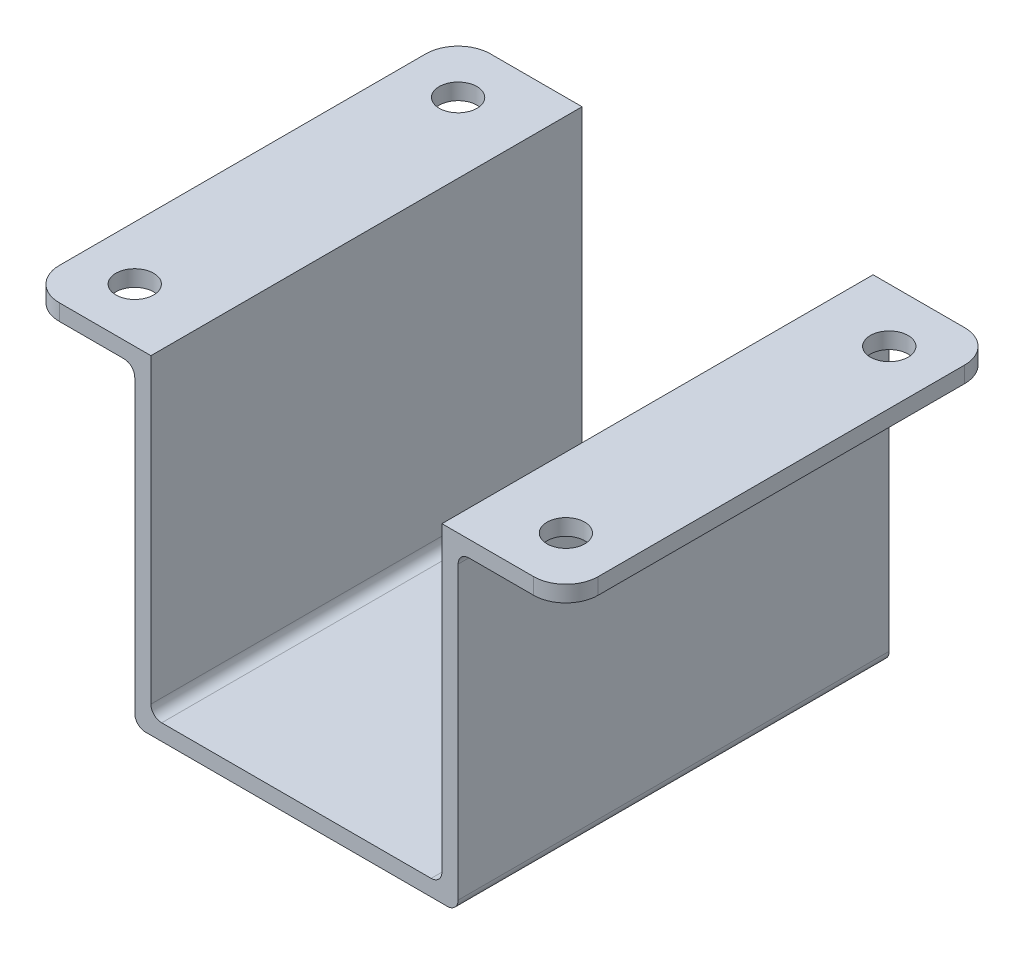
ISO-10303-21;
HEADER;
FILE_DESCRIPTION(('STEP AP214'),'2;1');
FILE_NAME('part.step','',(''),(''),'','','');
FILE_SCHEMA(('AUTOMOTIVE_DESIGN { 1 0 10303 214 1 1 1 1 }'));
ENDSEC;
DATA;
#1=APPLICATION_CONTEXT('core data for automotive mechanical design processes');
#2=APPLICATION_PROTOCOL_DEFINITION('international standard','automotive_design',2000,#1);
#3=PRODUCT_CONTEXT('',#1,'mechanical');
#4=PRODUCT('Part','Part','',(#3));
#5=PRODUCT_RELATED_PRODUCT_CATEGORY('part','',(#4));
#6=PRODUCT_DEFINITION_FORMATION('','',#4);
#7=PRODUCT_DEFINITION_CONTEXT('part definition',#1,'design');
#8=PRODUCT_DEFINITION('design','',#6,#7);
#9=PRODUCT_DEFINITION_SHAPE('','',#8);
#10=(LENGTH_UNIT() NAMED_UNIT(*) SI_UNIT(.MILLI.,.METRE.));
#11=(NAMED_UNIT(*) PLANE_ANGLE_UNIT() SI_UNIT($,.RADIAN.));
#12=(NAMED_UNIT(*) SI_UNIT($,.STERADIAN.) SOLID_ANGLE_UNIT());
#13=UNCERTAINTY_MEASURE_WITH_UNIT(LENGTH_MEASURE(1.E-05),#10,'distance_accuracy_value','');
#14=(GEOMETRIC_REPRESENTATION_CONTEXT(3) GLOBAL_UNCERTAINTY_ASSIGNED_CONTEXT((#13)) GLOBAL_UNIT_ASSIGNED_CONTEXT((#10,
#11,#12)) REPRESENTATION_CONTEXT('',''));
#15=CARTESIAN_POINT('',(0.,0.,0.));
#16=DIRECTION('',(0.,0.,1.));
#17=DIRECTION('',(1.,0.,0.));
#18=AXIS2_PLACEMENT_3D('',#15,#16,#17);
#19=CARTESIAN_POINT('',(0.,1.5,0.));
#20=DIRECTION('',(0.,1.,0.));
#21=DIRECTION('',(0.,0.,1.));
#22=AXIS2_PLACEMENT_3D('',#19,#20,#21);
#23=PLANE('',#22);
#24=DIRECTION('',(1.,0.,0.));
#25=VECTOR('',#24,1.);
#26=CARTESIAN_POINT('',(-15.,1.5,20.));
#27=LINE('',#26,#25);
#28=CARTESIAN_POINT('',(-12.5,1.5,20.));
#29=VERTEX_POINT('',#28);
#30=CARTESIAN_POINT('',(12.5,1.5,20.));
#31=VERTEX_POINT('',#30);
#32=EDGE_CURVE('E292',#29,#31,#27,.T.);
#33=ORIENTED_EDGE('',*,*,#32,.T.);
#34=DIRECTION('',(0.,0.,1.));
#35=VECTOR('',#34,1.);
#36=CARTESIAN_POINT('',(12.5,1.5,-20.));
#37=LINE('',#36,#35);
#38=CARTESIAN_POINT('',(12.5,1.5,-20.));
#39=VERTEX_POINT('',#38);
#40=EDGE_CURVE('E352',#31,#39,#37,.F.);
#41=ORIENTED_EDGE('',*,*,#40,.T.);
#42=DIRECTION('',(-1.,0.,0.));
#43=VECTOR('',#42,1.);
#44=CARTESIAN_POINT('',(-15.,1.5,-20.));
#45=LINE('',#44,#43);
#46=CARTESIAN_POINT('',(-12.5,1.5,-20.));
#47=VERTEX_POINT('',#46);
#48=EDGE_CURVE('E296',#39,#47,#45,.T.);
#49=ORIENTED_EDGE('',*,*,#48,.T.);
#50=DIRECTION('',(0.,0.,-1.));
#51=VECTOR('',#50,1.);
#52=CARTESIAN_POINT('',(-12.5,1.5,20.));
#53=LINE('',#52,#51);
#54=EDGE_CURVE('E349',#47,#29,#53,.F.);
#55=ORIENTED_EDGE('',*,*,#54,.T.);
#56=EDGE_LOOP('',(#33,#41,#49,#55));
#57=FACE_BOUND('',#56,.T.);
#58=CARTESIAN_POINT('',(0.,1.5,0.));
#59=DIRECTION('',(0.,1.,0.));
#60=DIRECTION('',(0.,0.,1.));
#61=AXIS2_PLACEMENT_3D('',#58,#59,#60);
#62=CIRCLE('',#61,4.25);
#63=CARTESIAN_POINT('',(0.,1.5,4.25));
#64=VERTEX_POINT('',#63);
#65=EDGE_CURVE('E284',#64,#64,#62,.T.);
#66=ORIENTED_EDGE('',*,*,#65,.F.);
#67=EDGE_LOOP('',(#66));
#68=FACE_BOUND('',#67,.T.);
#69=ADVANCED_FACE('F39',(#57,#68),#23,.T.);
#70=CARTESIAN_POINT('',(0.,0.,0.));
#71=DIRECTION('',(0.,1.,0.));
#72=DIRECTION('',(0.,0.,1.));
#73=AXIS2_PLACEMENT_3D('',#70,#71,#72);
#74=PLANE('',#73);
#75=DIRECTION('',(-1.,0.,0.));
#76=VECTOR('',#75,1.);
#77=CARTESIAN_POINT('',(-15.,0.,-20.));
#78=LINE('',#77,#76);
#79=CARTESIAN_POINT('',(14.,0.,-20.));
#80=VERTEX_POINT('',#79);
#81=CARTESIAN_POINT('',(-14.,0.,-20.));
#82=VERTEX_POINT('',#81);
#83=EDGE_CURVE('E297',#80,#82,#78,.T.);
#84=ORIENTED_EDGE('',*,*,#83,.F.);
#85=DIRECTION('',(0.,0.,-1.));
#86=VECTOR('',#85,1.);
#87=CARTESIAN_POINT('',(14.,0.,0.));
#88=LINE('',#87,#86);
#89=CARTESIAN_POINT('',(14.,0.,20.));
#90=VERTEX_POINT('',#89);
#91=EDGE_CURVE('E368',#80,#90,#88,.F.);
#92=ORIENTED_EDGE('',*,*,#91,.T.);
#93=DIRECTION('',(1.,0.,0.));
#94=VECTOR('',#93,1.);
#95=CARTESIAN_POINT('',(-15.,0.,20.));
#96=LINE('',#95,#94);
#97=CARTESIAN_POINT('',(-14.,0.,20.));
#98=VERTEX_POINT('',#97);
#99=EDGE_CURVE('E288',#98,#90,#96,.T.);
#100=ORIENTED_EDGE('',*,*,#99,.F.);
#101=DIRECTION('',(0.,0.,1.));
#102=VECTOR('',#101,1.);
#103=CARTESIAN_POINT('',(-14.,0.,0.));
#104=LINE('',#103,#102);
#105=EDGE_CURVE('E365',#98,#82,#104,.F.);
#106=ORIENTED_EDGE('',*,*,#105,.T.);
#107=EDGE_LOOP('',(#84,#92,#100,#106));
#108=FACE_BOUND('',#107,.T.);
#109=CARTESIAN_POINT('',(0.,0.,0.));
#110=DIRECTION('',(0.,1.,0.));
#111=DIRECTION('',(0.,0.,1.));
#112=AXIS2_PLACEMENT_3D('',#109,#110,#111);
#113=CIRCLE('',#112,4.25);
#114=CARTESIAN_POINT('',(0.,0.,4.25));
#115=VERTEX_POINT('',#114);
#116=EDGE_CURVE('E280',#115,#115,#113,.T.);
#117=ORIENTED_EDGE('',*,*,#116,.T.);
#118=EDGE_LOOP('',(#117));
#119=FACE_BOUND('',#118,.T.);
#120=ADVANCED_FACE('F485',(#108,#119),#74,.F.);
#121=CARTESIAN_POINT('',(-15.,1.5,-20.));
#122=DIRECTION('',(1.,0.,0.));
#123=DIRECTION('',(0.,0.,-1.));
#124=AXIS2_PLACEMENT_3D('',#121,#122,#123);
#125=PLANE('',#124);
#126=DIRECTION('',(0.,-1.,0.));
#127=VECTOR('',#126,1.);
#128=CARTESIAN_POINT('',(-15.,1.5,20.));
#129=LINE('',#128,#127);
#130=CARTESIAN_POINT('',(-15.,28.,20.));
#131=VERTEX_POINT('',#130);
#132=CARTESIAN_POINT('',(-15.,1.,20.));
#133=VERTEX_POINT('',#132);
#134=EDGE_CURVE('E319',#131,#133,#129,.T.);
#135=ORIENTED_EDGE('',*,*,#134,.F.);
#136=DIRECTION('',(0.,0.,-1.));
#137=VECTOR('',#136,1.);
#138=CARTESIAN_POINT('',(-15.,28.,-20.));
#139=LINE('',#138,#137);
#140=CARTESIAN_POINT('',(-15.,28.,-20.));
#141=VERTEX_POINT('',#140);
#142=EDGE_CURVE('E338',#131,#141,#139,.T.);
#143=ORIENTED_EDGE('',*,*,#142,.T.);
#144=DIRECTION('',(0.,-1.,0.));
#145=VECTOR('',#144,1.);
#146=CARTESIAN_POINT('',(-15.,1.5,-20.));
#147=LINE('',#146,#145);
#148=CARTESIAN_POINT('',(-15.,1.,-20.));
#149=VERTEX_POINT('',#148);
#150=EDGE_CURVE('E301',#141,#149,#147,.T.);
#151=ORIENTED_EDGE('',*,*,#150,.T.);
#152=DIRECTION('',(0.,0.,1.));
#153=VECTOR('',#152,1.);
#154=CARTESIAN_POINT('',(-15.,1.,-20.));
#155=LINE('',#154,#153);
#156=EDGE_CURVE('E334',#149,#133,#155,.T.);
#157=ORIENTED_EDGE('',*,*,#156,.T.);
#158=EDGE_LOOP('',(#135,#143,#151,#157));
#159=FACE_BOUND('',#158,.T.);
#160=ADVANCED_FACE('F475',(#159),#125,.F.);
#161=CARTESIAN_POINT('',(-15.,1.5,20.));
#162=DIRECTION('',(0.,0.,-1.));
#163=DIRECTION('',(-1.,0.,0.));
#164=AXIS2_PLACEMENT_3D('',#161,#162,#163);
#165=PLANE('',#164);
#166=DIRECTION('',(-1.,0.,0.));
#167=VECTOR('',#166,1.);
#168=CARTESIAN_POINT('',(13.5,29.,20.));
#169=LINE('',#168,#167);
#170=CARTESIAN_POINT('',(22.,29.,20.));
#171=VERTEX_POINT('',#170);
#172=CARTESIAN_POINT('',(16.,29.,20.));
#173=VERTEX_POINT('',#172);
#174=EDGE_CURVE('E500',#171,#173,#169,.T.);
#175=ORIENTED_EDGE('',*,*,#174,.F.);
#176=DIRECTION('',(0.,1.,0.));
#177=VECTOR('',#176,1.);
#178=CARTESIAN_POINT('',(22.,1.5,20.));
#179=LINE('',#178,#177);
#180=CARTESIAN_POINT('',(22.,30.5,20.));
#181=VERTEX_POINT('',#180);
#182=EDGE_CURVE('E11',#171,#181,#179,.T.);
#183=ORIENTED_EDGE('',*,*,#182,.T.);
#184=DIRECTION('',(1.,0.,0.));
#185=VECTOR('',#184,1.);
#186=CARTESIAN_POINT('',(13.5,30.5,20.));
#187=LINE('',#186,#185);
#188=CARTESIAN_POINT('',(13.5,30.5,20.));
#189=VERTEX_POINT('',#188);
#190=EDGE_CURVE('E213',#189,#181,#187,.T.);
#191=ORIENTED_EDGE('',*,*,#190,.F.);
#192=DIRECTION('',(0.,1.,0.));
#193=VECTOR('',#192,1.);
#194=CARTESIAN_POINT('',(13.5,0.,20.));
#195=LINE('',#194,#193);
#196=CARTESIAN_POINT('',(13.5,2.5,20.));
#197=VERTEX_POINT('',#196);
#198=EDGE_CURVE('E198',#197,#189,#195,.T.);
#199=ORIENTED_EDGE('',*,*,#198,.F.);
#200=CARTESIAN_POINT('',(12.5,2.5,20.));
#201=DIRECTION('',(0.,0.,-1.));
#202=DIRECTION('',(-1.,0.,0.));
#203=AXIS2_PLACEMENT_3D('',#200,#201,#202);
#204=CIRCLE('',#203,1.);
#205=EDGE_CURVE('E390',#197,#31,#204,.T.);
#206=ORIENTED_EDGE('',*,*,#205,.T.);
#207=ORIENTED_EDGE('',*,*,#32,.F.);
#208=CARTESIAN_POINT('',(-12.5,2.5,20.));
#209=DIRECTION('',(0.,0.,-1.));
#210=DIRECTION('',(-1.,0.,0.));
#211=AXIS2_PLACEMENT_3D('',#208,#209,#210);
#212=CIRCLE('',#211,1.);
#213=CARTESIAN_POINT('',(-13.5,2.5,20.));
#214=VERTEX_POINT('',#213);
#215=EDGE_CURVE('E398',#29,#214,#212,.T.);
#216=ORIENTED_EDGE('',*,*,#215,.T.);
#217=DIRECTION('',(0.,1.,0.));
#218=VECTOR('',#217,1.);
#219=CARTESIAN_POINT('',(-13.5,0.,20.));
#220=LINE('',#219,#218);
#221=CARTESIAN_POINT('',(-13.5,30.5,20.));
#222=VERTEX_POINT('',#221);
#223=EDGE_CURVE('E268',#214,#222,#220,.T.);
#224=ORIENTED_EDGE('',*,*,#223,.T.);
#225=DIRECTION('',(-1.,0.,0.));
#226=VECTOR('',#225,1.);
#227=CARTESIAN_POINT('',(-13.5,30.5,20.));
#228=LINE('',#227,#226);
#229=CARTESIAN_POINT('',(-22.,30.5,20.));
#230=VERTEX_POINT('',#229);
#231=EDGE_CURVE('E275',#222,#230,#228,.T.);
#232=ORIENTED_EDGE('',*,*,#231,.T.);
#233=DIRECTION('',(0.,1.,0.));
#234=VECTOR('',#233,1.);
#235=CARTESIAN_POINT('',(-22.,29.,20.));
#236=LINE('',#235,#234);
#237=CARTESIAN_POINT('',(-22.,29.,20.));
#238=VERTEX_POINT('',#237);
#239=EDGE_CURVE('E48',#230,#238,#236,.F.);
#240=ORIENTED_EDGE('',*,*,#239,.T.);
#241=DIRECTION('',(1.,0.,0.));
#242=VECTOR('',#241,1.);
#243=CARTESIAN_POINT('',(-13.5,29.,20.));
#244=LINE('',#243,#242);
#245=CARTESIAN_POINT('',(-16.,29.,20.));
#246=VERTEX_POINT('',#245);
#247=EDGE_CURVE('E258',#238,#246,#244,.T.);
#248=ORIENTED_EDGE('',*,*,#247,.T.);
#249=CARTESIAN_POINT('',(-16.,28.,20.));
#250=DIRECTION('',(0.,0.,-1.));
#251=DIRECTION('',(-1.,0.,0.));
#252=AXIS2_PLACEMENT_3D('',#249,#250,#251);
#253=CIRCLE('',#252,1.);
#254=EDGE_CURVE('E387',#246,#131,#253,.T.);
#255=ORIENTED_EDGE('',*,*,#254,.T.);
#256=ORIENTED_EDGE('',*,*,#134,.T.);
#257=CARTESIAN_POINT('',(-14.,1.,20.));
#258=DIRECTION('',(0.,0.,-1.));
#259=DIRECTION('',(-1.,0.,0.));
#260=AXIS2_PLACEMENT_3D('',#257,#258,#259);
#261=CIRCLE('',#260,1.);
#262=EDGE_CURVE('E371',#133,#98,#261,.F.);
#263=ORIENTED_EDGE('',*,*,#262,.T.);
#264=ORIENTED_EDGE('',*,*,#99,.T.);
#265=CARTESIAN_POINT('',(14.,1.,20.));
#266=DIRECTION('',(0.,0.,-1.));
#267=DIRECTION('',(-1.,0.,0.));
#268=AXIS2_PLACEMENT_3D('',#265,#266,#267);
#269=CIRCLE('',#268,1.);
#270=CARTESIAN_POINT('',(15.,1.,20.));
#271=VERTEX_POINT('',#270);
#272=EDGE_CURVE('E374',#90,#271,#269,.F.);
#273=ORIENTED_EDGE('',*,*,#272,.T.);
#274=DIRECTION('',(0.,-1.,0.));
#275=VECTOR('',#274,1.);
#276=CARTESIAN_POINT('',(15.,1.5,20.));
#277=LINE('',#276,#275);
#278=CARTESIAN_POINT('',(15.,28.,20.));
#279=VERTEX_POINT('',#278);
#280=EDGE_CURVE('E315',#279,#271,#277,.T.);
#281=ORIENTED_EDGE('',*,*,#280,.F.);
#282=CARTESIAN_POINT('',(16.,28.,20.));
#283=DIRECTION('',(0.,0.,-1.));
#284=DIRECTION('',(-1.,0.,0.));
#285=AXIS2_PLACEMENT_3D('',#282,#283,#284);
#286=CIRCLE('',#285,1.);
#287=EDGE_CURVE('E377',#279,#173,#286,.T.);
#288=ORIENTED_EDGE('',*,*,#287,.T.);
#289=EDGE_LOOP('',(#175,#183,#191,#199,#206,#207,#216,#224,#232,#240,#248,#255,#256,#263,#264,
#273,#281,#288));
#290=FACE_BOUND('',#289,.T.);
#291=ADVANCED_FACE('F446',(#290),#165,.F.);
#292=CARTESIAN_POINT('',(15.,1.5,-20.));
#293=DIRECTION('',(-1.,0.,0.));
#294=DIRECTION('',(0.,0.,1.));
#295=AXIS2_PLACEMENT_3D('',#292,#293,#294);
#296=PLANE('',#295);
#297=DIRECTION('',(0.,-1.,0.));
#298=VECTOR('',#297,1.);
#299=CARTESIAN_POINT('',(15.,1.5,-20.));
#300=LINE('',#299,#298);
#301=CARTESIAN_POINT('',(15.,28.,-20.));
#302=VERTEX_POINT('',#301);
#303=CARTESIAN_POINT('',(15.,1.,-20.));
#304=VERTEX_POINT('',#303);
#305=EDGE_CURVE('E311',#302,#304,#300,.T.);
#306=ORIENTED_EDGE('',*,*,#305,.F.);
#307=DIRECTION('',(0.,0.,1.));
#308=VECTOR('',#307,1.);
#309=CARTESIAN_POINT('',(15.,28.,-20.));
#310=LINE('',#309,#308);
#311=EDGE_CURVE('E327',#302,#279,#310,.T.);
#312=ORIENTED_EDGE('',*,*,#311,.T.);
#313=ORIENTED_EDGE('',*,*,#280,.T.);
#314=DIRECTION('',(0.,0.,-1.));
#315=VECTOR('',#314,1.);
#316=CARTESIAN_POINT('',(15.,1.,-20.));
#317=LINE('',#316,#315);
#318=EDGE_CURVE('E323',#271,#304,#317,.T.);
#319=ORIENTED_EDGE('',*,*,#318,.T.);
#320=EDGE_LOOP('',(#306,#312,#313,#319));
#321=FACE_BOUND('',#320,.T.);
#322=ADVANCED_FACE('F494',(#321),#296,.F.);
#323=CARTESIAN_POINT('',(-15.,1.5,-20.));
#324=DIRECTION('',(0.,0.,1.));
#325=DIRECTION('',(1.,0.,0.));
#326=AXIS2_PLACEMENT_3D('',#323,#324,#325);
#327=PLANE('',#326);
#328=DIRECTION('',(-1.,0.,0.));
#329=VECTOR('',#328,1.);
#330=CARTESIAN_POINT('',(-13.5,29.,-20.));
#331=LINE('',#330,#329);
#332=CARTESIAN_POINT('',(-16.,29.,-20.));
#333=VERTEX_POINT('',#332);
#334=CARTESIAN_POINT('',(-22.,29.,-20.));
#335=VERTEX_POINT('',#334);
#336=EDGE_CURVE('E251',#333,#335,#331,.T.);
#337=ORIENTED_EDGE('',*,*,#336,.T.);
#338=DIRECTION('',(0.,1.,0.));
#339=VECTOR('',#338,1.);
#340=CARTESIAN_POINT('',(-22.,30.5,-20.));
#341=LINE('',#340,#339);
#342=CARTESIAN_POINT('',(-22.,30.5,-20.));
#343=VERTEX_POINT('',#342);
#344=EDGE_CURVE('E404',#335,#343,#341,.T.);
#345=ORIENTED_EDGE('',*,*,#344,.T.);
#346=DIRECTION('',(-1.,0.,0.));
#347=VECTOR('',#346,1.);
#348=CARTESIAN_POINT('',(-13.5,30.5,-20.));
#349=LINE('',#348,#347);
#350=CARTESIAN_POINT('',(-13.5,30.5,-20.));
#351=VERTEX_POINT('',#350);
#352=EDGE_CURVE('E276',#351,#343,#349,.T.);
#353=ORIENTED_EDGE('',*,*,#352,.F.);
#354=DIRECTION('',(0.,-1.,0.));
#355=VECTOR('',#354,1.);
#356=CARTESIAN_POINT('',(-13.5,0.,-20.));
#357=LINE('',#356,#355);
#358=CARTESIAN_POINT('',(-13.5,2.5,-20.));
#359=VERTEX_POINT('',#358);
#360=EDGE_CURVE('E261',#351,#359,#357,.T.);
#361=ORIENTED_EDGE('',*,*,#360,.T.);
#362=CARTESIAN_POINT('',(-12.5,2.5,-20.));
#363=DIRECTION('',(0.,0.,1.));
#364=DIRECTION('',(1.,0.,0.));
#365=AXIS2_PLACEMENT_3D('',#362,#363,#364);
#366=CIRCLE('',#365,1.);
#367=EDGE_CURVE('E395',#359,#47,#366,.T.);
#368=ORIENTED_EDGE('',*,*,#367,.T.);
#369=ORIENTED_EDGE('',*,*,#48,.F.);
#370=CARTESIAN_POINT('',(12.5,2.5,-20.));
#371=DIRECTION('',(0.,0.,1.));
#372=DIRECTION('',(1.,0.,0.));
#373=AXIS2_PLACEMENT_3D('',#370,#371,#372);
#374=CIRCLE('',#373,1.);
#375=CARTESIAN_POINT('',(13.5,2.5,-20.));
#376=VERTEX_POINT('',#375);
#377=EDGE_CURVE('E219',#39,#376,#374,.T.);
#378=ORIENTED_EDGE('',*,*,#377,.T.);
#379=DIRECTION('',(0.,-1.,0.));
#380=VECTOR('',#379,1.);
#381=CARTESIAN_POINT('',(13.5,0.,-20.));
#382=LINE('',#381,#380);
#383=CARTESIAN_POINT('',(13.5,30.5,-20.));
#384=VERTEX_POINT('',#383);
#385=EDGE_CURVE('E195',#384,#376,#382,.T.);
#386=ORIENTED_EDGE('',*,*,#385,.F.);
#387=DIRECTION('',(1.,0.,0.));
#388=VECTOR('',#387,1.);
#389=CARTESIAN_POINT('',(13.5,30.5,-20.));
#390=LINE('',#389,#388);
#391=CARTESIAN_POINT('',(22.,30.5,-20.));
#392=VERTEX_POINT('',#391);
#393=EDGE_CURVE('E205',#384,#392,#390,.T.);
#394=ORIENTED_EDGE('',*,*,#393,.T.);
#395=DIRECTION('',(0.,1.,0.));
#396=VECTOR('',#395,1.);
#397=CARTESIAN_POINT('',(22.,1.5,-20.));
#398=LINE('',#397,#396);
#399=CARTESIAN_POINT('',(22.,29.,-20.));
#400=VERTEX_POINT('',#399);
#401=EDGE_CURVE('E401',#392,#400,#398,.F.);
#402=ORIENTED_EDGE('',*,*,#401,.T.);
#403=DIRECTION('',(1.,0.,0.));
#404=VECTOR('',#403,1.);
#405=CARTESIAN_POINT('',(13.5,29.,-20.));
#406=LINE('',#405,#404);
#407=CARTESIAN_POINT('',(16.,29.,-20.));
#408=VERTEX_POINT('',#407);
#409=EDGE_CURVE('E221',#408,#400,#406,.T.);
#410=ORIENTED_EDGE('',*,*,#409,.F.);
#411=CARTESIAN_POINT('',(16.,28.,-20.));
#412=DIRECTION('',(0.,0.,1.));
#413=DIRECTION('',(1.,0.,0.));
#414=AXIS2_PLACEMENT_3D('',#411,#412,#413);
#415=CIRCLE('',#414,1.);
#416=EDGE_CURVE('E381',#408,#302,#415,.T.);
#417=ORIENTED_EDGE('',*,*,#416,.T.);
#418=ORIENTED_EDGE('',*,*,#305,.T.);
#419=CARTESIAN_POINT('',(14.,1.,-20.));
#420=DIRECTION('',(0.,0.,1.));
#421=DIRECTION('',(1.,0.,0.));
#422=AXIS2_PLACEMENT_3D('',#419,#420,#421);
#423=CIRCLE('',#422,1.);
#424=EDGE_CURVE('E362',#304,#80,#423,.F.);
#425=ORIENTED_EDGE('',*,*,#424,.T.);
#426=ORIENTED_EDGE('',*,*,#83,.T.);
#427=CARTESIAN_POINT('',(-14.,1.,-20.));
#428=DIRECTION('',(0.,0.,1.));
#429=DIRECTION('',(1.,0.,0.));
#430=AXIS2_PLACEMENT_3D('',#427,#428,#429);
#431=CIRCLE('',#430,1.);
#432=EDGE_CURVE('E359',#82,#149,#431,.F.);
#433=ORIENTED_EDGE('',*,*,#432,.T.);
#434=ORIENTED_EDGE('',*,*,#150,.F.);
#435=CARTESIAN_POINT('',(-16.,28.,-20.));
#436=DIRECTION('',(0.,0.,1.));
#437=DIRECTION('',(1.,0.,0.));
#438=AXIS2_PLACEMENT_3D('',#435,#436,#437);
#439=CIRCLE('',#438,1.);
#440=EDGE_CURVE('E384',#141,#333,#439,.T.);
#441=ORIENTED_EDGE('',*,*,#440,.T.);
#442=EDGE_LOOP('',(#337,#345,#353,#361,#368,#369,#378,#386,#394,#402,#410,#417,#418,#425,#426,
#433,#434,#441));
#443=FACE_BOUND('',#442,.T.);
#444=ADVANCED_FACE('F216',(#443),#327,.F.);
#445=CARTESIAN_POINT('',(0.,1.5,0.));
#446=DIRECTION('',(0.,-1.,0.));
#447=DIRECTION('',(0.,0.,-1.));
#448=AXIS2_PLACEMENT_3D('',#445,#446,#447);
#449=CYLINDRICAL_SURFACE('',#448,4.25);
#450=ORIENTED_EDGE('',*,*,#65,.T.);
#451=EDGE_LOOP('',(#450));
#452=FACE_BOUND('',#451,.T.);
#453=ORIENTED_EDGE('',*,*,#116,.F.);
#454=EDGE_LOOP('',(#453));
#455=FACE_BOUND('',#454,.T.);
#456=ADVANCED_FACE('F564',(#452,#455),#449,.F.);
#457=CARTESIAN_POINT('',(-13.5,30.5,-20.));
#458=DIRECTION('',(0.,1.,0.));
#459=DIRECTION('',(0.,0.,1.));
#460=AXIS2_PLACEMENT_3D('',#457,#458,#459);
#461=PLANE('',#460);
#462=ORIENTED_EDGE('',*,*,#352,.T.);
#463=CARTESIAN_POINT('',(-22.,30.5,-17.));
#464=DIRECTION('',(0.,1.,0.));
#465=DIRECTION('',(0.,0.,1.));
#466=AXIS2_PLACEMENT_3D('',#463,#464,#465);
#467=CIRCLE('',#466,3.);
#468=CARTESIAN_POINT('',(-25.,30.5,-17.));
#469=VERTEX_POINT('',#468);
#470=EDGE_CURVE('E411',#343,#469,#467,.T.);
#471=ORIENTED_EDGE('',*,*,#470,.T.);
#472=DIRECTION('',(0.,0.,1.));
#473=VECTOR('',#472,1.);
#474=CARTESIAN_POINT('',(-25.,30.5,-20.));
#475=LINE('',#474,#473);
#476=CARTESIAN_POINT('',(-25.,30.5,17.));
#477=VERTEX_POINT('',#476);
#478=EDGE_CURVE('E247',#469,#477,#475,.T.);
#479=ORIENTED_EDGE('',*,*,#478,.T.);
#480=CARTESIAN_POINT('',(-22.,30.5,17.));
#481=DIRECTION('',(0.,1.,0.));
#482=DIRECTION('',(0.,0.,1.));
#483=AXIS2_PLACEMENT_3D('',#480,#481,#482);
#484=CIRCLE('',#483,3.);
#485=EDGE_CURVE('E408',#477,#230,#484,.T.);
#486=ORIENTED_EDGE('',*,*,#485,.T.);
#487=ORIENTED_EDGE('',*,*,#231,.F.);
#488=DIRECTION('',(0.,0.,-1.));
#489=VECTOR('',#488,1.);
#490=CARTESIAN_POINT('',(-13.5,30.5,-20.));
#491=LINE('',#490,#489);
#492=EDGE_CURVE('E271',#222,#351,#491,.T.);
#493=ORIENTED_EDGE('',*,*,#492,.T.);
#494=EDGE_LOOP('',(#462,#471,#479,#486,#487,#493));
#495=FACE_BOUND('',#494,.T.);
#496=CARTESIAN_POINT('',(-19.9999999999997,30.5,15.));
#497=DIRECTION('',(0.,1.,0.));
#498=DIRECTION('',(0.,0.,1.));
#499=AXIS2_PLACEMENT_3D('',#496,#497,#498);
#500=CIRCLE('',#499,1.75);
#501=CARTESIAN_POINT('',(-19.9999999999997,30.5,16.75));
#502=VERTEX_POINT('',#501);
#503=EDGE_CURVE('E233',#502,#502,#500,.T.);
#504=ORIENTED_EDGE('',*,*,#503,.F.);
#505=EDGE_LOOP('',(#504));
#506=FACE_BOUND('',#505,.T.);
#507=CARTESIAN_POINT('',(-20.,30.5,-15.));
#508=DIRECTION('',(0.,1.,0.));
#509=DIRECTION('',(0.,0.,1.));
#510=AXIS2_PLACEMENT_3D('',#507,#508,#509);
#511=CIRCLE('',#510,1.75);
#512=CARTESIAN_POINT('',(-20.,30.5,-13.25));
#513=VERTEX_POINT('',#512);
#514=EDGE_CURVE('E239',#513,#513,#511,.T.);
#515=ORIENTED_EDGE('',*,*,#514,.F.);
#516=EDGE_LOOP('',(#515));
#517=FACE_BOUND('',#516,.T.);
#518=ADVANCED_FACE('F462',(#495,#506,#517),#461,.T.);
#519=CARTESIAN_POINT('',(-13.5,0.,0.));
#520=DIRECTION('',(1.,0.,0.));
#521=DIRECTION('',(0.,0.,-1.));
#522=AXIS2_PLACEMENT_3D('',#519,#520,#521);
#523=PLANE('',#522);
#524=ORIENTED_EDGE('',*,*,#223,.F.);
#525=DIRECTION('',(0.,0.,-1.));
#526=VECTOR('',#525,1.);
#527=CARTESIAN_POINT('',(-13.5,2.5,-20.));
#528=LINE('',#527,#526);
#529=EDGE_CURVE('E355',#214,#359,#528,.T.);
#530=ORIENTED_EDGE('',*,*,#529,.T.);
#531=ORIENTED_EDGE('',*,*,#360,.F.);
#532=ORIENTED_EDGE('',*,*,#492,.F.);
#533=EDGE_LOOP('',(#524,#530,#531,#532));
#534=FACE_BOUND('',#533,.T.);
#535=ADVANCED_FACE('F662',(#534),#523,.T.);
#536=CARTESIAN_POINT('',(0.,29.,0.));
#537=DIRECTION('',(0.,-1.,0.));
#538=DIRECTION('',(0.,0.,-1.));
#539=AXIS2_PLACEMENT_3D('',#536,#537,#538);
#540=PLANE('',#539);
#541=CARTESIAN_POINT('',(-20.,29.,-15.));
#542=DIRECTION('',(0.,1.,0.));
#543=DIRECTION('',(0.,0.,1.));
#544=AXIS2_PLACEMENT_3D('',#541,#542,#543);
#545=CIRCLE('',#544,1.75);
#546=CARTESIAN_POINT('',(-20.,29.,-13.25));
#547=VERTEX_POINT('',#546);
#548=EDGE_CURVE('E243',#547,#547,#545,.T.);
#549=ORIENTED_EDGE('',*,*,#548,.T.);
#550=EDGE_LOOP('',(#549));
#551=FACE_BOUND('',#550,.T.);
#552=CARTESIAN_POINT('',(-19.9999999999997,29.,15.));
#553=DIRECTION('',(0.,1.,0.));
#554=DIRECTION('',(0.,0.,1.));
#555=AXIS2_PLACEMENT_3D('',#552,#553,#554);
#556=CIRCLE('',#555,1.75);
#557=CARTESIAN_POINT('',(-19.9999999999997,29.,16.75));
#558=VERTEX_POINT('',#557);
#559=EDGE_CURVE('E235',#558,#558,#556,.T.);
#560=ORIENTED_EDGE('',*,*,#559,.T.);
#561=EDGE_LOOP('',(#560));
#562=FACE_BOUND('',#561,.T.);
#563=DIRECTION('',(0.,0.,1.));
#564=VECTOR('',#563,1.);
#565=CARTESIAN_POINT('',(-25.,29.,-20.));
#566=LINE('',#565,#564);
#567=CARTESIAN_POINT('',(-25.,29.,-17.));
#568=VERTEX_POINT('',#567);
#569=CARTESIAN_POINT('',(-25.,29.,17.));
#570=VERTEX_POINT('',#569);
#571=EDGE_CURVE('E254',#568,#570,#566,.T.);
#572=ORIENTED_EDGE('',*,*,#571,.F.);
#573=CARTESIAN_POINT('',(-22.,29.,-17.));
#574=DIRECTION('',(0.,-1.,0.));
#575=DIRECTION('',(0.,0.,-1.));
#576=AXIS2_PLACEMENT_3D('',#573,#574,#575);
#577=CIRCLE('',#576,3.);
#578=EDGE_CURVE('E424',#568,#335,#577,.T.);
#579=ORIENTED_EDGE('',*,*,#578,.T.);
#580=ORIENTED_EDGE('',*,*,#336,.F.);
#581=DIRECTION('',(0.,0.,-1.));
#582=VECTOR('',#581,1.);
#583=CARTESIAN_POINT('',(-16.,29.,0.));
#584=LINE('',#583,#582);
#585=EDGE_CURVE('E342',#333,#246,#584,.F.);
#586=ORIENTED_EDGE('',*,*,#585,.T.);
#587=ORIENTED_EDGE('',*,*,#247,.F.);
#588=CARTESIAN_POINT('',(-22.,29.,17.));
#589=DIRECTION('',(0.,-1.,0.));
#590=DIRECTION('',(0.,0.,-1.));
#591=AXIS2_PLACEMENT_3D('',#588,#589,#590);
#592=CIRCLE('',#591,3.);
#593=EDGE_CURVE('E421',#238,#570,#592,.T.);
#594=ORIENTED_EDGE('',*,*,#593,.T.);
#595=EDGE_LOOP('',(#572,#579,#580,#586,#587,#594));
#596=FACE_BOUND('',#595,.T.);
#597=ADVANCED_FACE('F452',(#551,#562,#596),#540,.T.);
#598=CARTESIAN_POINT('',(-25.,29.,-20.));
#599=DIRECTION('',(-1.,0.,0.));
#600=DIRECTION('',(0.,0.,1.));
#601=AXIS2_PLACEMENT_3D('',#598,#599,#600);
#602=PLANE('',#601);
#603=ORIENTED_EDGE('',*,*,#478,.F.);
#604=DIRECTION('',(0.,1.,0.));
#605=VECTOR('',#604,1.);
#606=CARTESIAN_POINT('',(-25.,29.,-17.));
#607=LINE('',#606,#605);
#608=EDGE_CURVE('E418',#469,#568,#607,.F.);
#609=ORIENTED_EDGE('',*,*,#608,.T.);
#610=ORIENTED_EDGE('',*,*,#571,.T.);
#611=DIRECTION('',(0.,1.,0.));
#612=VECTOR('',#611,1.);
#613=CARTESIAN_POINT('',(-25.,30.5,17.));
#614=LINE('',#613,#612);
#615=EDGE_CURVE('E414',#570,#477,#614,.T.);
#616=ORIENTED_EDGE('',*,*,#615,.T.);
#617=EDGE_LOOP('',(#603,#609,#610,#616));
#618=FACE_BOUND('',#617,.T.);
#619=ADVANCED_FACE('F459',(#618),#602,.T.);
#620=CARTESIAN_POINT('',(-20.,29.,-15.));
#621=DIRECTION('',(0.,1.,0.));
#622=DIRECTION('',(0.,0.,1.));
#623=AXIS2_PLACEMENT_3D('',#620,#621,#622);
#624=CYLINDRICAL_SURFACE('',#623,1.75);
#625=ORIENTED_EDGE('',*,*,#548,.F.);
#626=EDGE_LOOP('',(#625));
#627=FACE_BOUND('',#626,.T.);
#628=ORIENTED_EDGE('',*,*,#514,.T.);
#629=EDGE_LOOP('',(#628));
#630=FACE_BOUND('',#629,.T.);
#631=ADVANCED_FACE('F651',(#627,#630),#624,.F.);
#632=CARTESIAN_POINT('',(-19.9999999999997,29.,15.));
#633=DIRECTION('',(0.,1.,0.));
#634=DIRECTION('',(0.,0.,1.));
#635=AXIS2_PLACEMENT_3D('',#632,#633,#634);
#636=CYLINDRICAL_SURFACE('',#635,1.75);
#637=ORIENTED_EDGE('',*,*,#559,.F.);
#638=EDGE_LOOP('',(#637));
#639=FACE_BOUND('',#638,.T.);
#640=ORIENTED_EDGE('',*,*,#503,.T.);
#641=EDGE_LOOP('',(#640));
#642=FACE_BOUND('',#641,.T.);
#643=ADVANCED_FACE('F546',(#639,#642),#636,.F.);
#644=CARTESIAN_POINT('',(13.5,30.5,-20.));
#645=DIRECTION('',(0.,-1.,0.));
#646=DIRECTION('',(0.,0.,-1.));
#647=AXIS2_PLACEMENT_3D('',#644,#645,#646);
#648=PLANE('',#647);
#649=DIRECTION('',(0.,0.,1.));
#650=VECTOR('',#649,1.);
#651=CARTESIAN_POINT('',(25.,30.5,-20.));
#652=LINE('',#651,#650);
#653=CARTESIAN_POINT('',(25.,30.5,-17.));
#654=VERTEX_POINT('',#653);
#655=CARTESIAN_POINT('',(25.,30.5,17.));
#656=VERTEX_POINT('',#655);
#657=EDGE_CURVE('E228',#654,#656,#652,.T.);
#658=ORIENTED_EDGE('',*,*,#657,.F.);
#659=CARTESIAN_POINT('',(22.,30.5,-17.));
#660=DIRECTION('',(0.,-1.,0.));
#661=DIRECTION('',(0.,0.,-1.));
#662=AXIS2_PLACEMENT_3D('',#659,#660,#661);
#663=CIRCLE('',#662,3.);
#664=EDGE_CURVE('E209',#654,#392,#663,.F.);
#665=ORIENTED_EDGE('',*,*,#664,.T.);
#666=ORIENTED_EDGE('',*,*,#393,.F.);
#667=DIRECTION('',(0.,0.,-1.));
#668=VECTOR('',#667,1.);
#669=CARTESIAN_POINT('',(13.5,30.5,-20.));
#670=LINE('',#669,#668);
#671=EDGE_CURVE('E190',#189,#384,#670,.T.);
#672=ORIENTED_EDGE('',*,*,#671,.F.);
#673=ORIENTED_EDGE('',*,*,#190,.T.);
#674=CARTESIAN_POINT('',(22.,30.5,17.));
#675=DIRECTION('',(0.,-1.,0.));
#676=DIRECTION('',(0.,0.,-1.));
#677=AXIS2_PLACEMENT_3D('',#674,#675,#676);
#678=CIRCLE('',#677,3.);
#679=EDGE_CURVE('E63',#181,#656,#678,.F.);
#680=ORIENTED_EDGE('',*,*,#679,.T.);
#681=EDGE_LOOP('',(#658,#665,#666,#672,#673,#680));
#682=FACE_BOUND('',#681,.T.);
#683=CARTESIAN_POINT('',(20.,30.5,-15.));
#684=DIRECTION('',(0.,-1.,0.));
#685=DIRECTION('',(0.,0.,1.));
#686=AXIS2_PLACEMENT_3D('',#683,#684,#685);
#687=CIRCLE('',#686,1.75);
#688=CARTESIAN_POINT('',(20.,30.5,-13.25));
#689=VERTEX_POINT('',#688);
#690=EDGE_CURVE('E514',#689,#689,#687,.T.);
#691=ORIENTED_EDGE('',*,*,#690,.T.);
#692=EDGE_LOOP('',(#691));
#693=FACE_BOUND('',#692,.T.);
#694=CARTESIAN_POINT('',(19.9999999999997,30.5,15.));
#695=DIRECTION('',(0.,-1.,0.));
#696=DIRECTION('',(0.,0.,1.));
#697=AXIS2_PLACEMENT_3D('',#694,#695,#696);
#698=CIRCLE('',#697,1.75);
#699=CARTESIAN_POINT('',(19.9999999999997,30.5,16.75));
#700=VERTEX_POINT('',#699);
#701=EDGE_CURVE('E523',#700,#700,#698,.T.);
#702=ORIENTED_EDGE('',*,*,#701,.T.);
#703=EDGE_LOOP('',(#702));
#704=FACE_BOUND('',#703,.T.);
#705=ADVANCED_FACE('F207',(#682,#693,#704),#648,.F.);
#706=CARTESIAN_POINT('',(13.5,0.,0.));
#707=DIRECTION('',(-1.,0.,0.));
#708=DIRECTION('',(0.,0.,-1.));
#709=AXIS2_PLACEMENT_3D('',#706,#707,#708);
#710=PLANE('',#709);
#711=ORIENTED_EDGE('',*,*,#385,.T.);
#712=DIRECTION('',(0.,0.,1.));
#713=VECTOR('',#712,1.);
#714=CARTESIAN_POINT('',(13.5,2.5,20.));
#715=LINE('',#714,#713);
#716=EDGE_CURVE('E346',#376,#197,#715,.T.);
#717=ORIENTED_EDGE('',*,*,#716,.T.);
#718=ORIENTED_EDGE('',*,*,#198,.T.);
#719=ORIENTED_EDGE('',*,*,#671,.T.);
#720=EDGE_LOOP('',(#711,#717,#718,#719));
#721=FACE_BOUND('',#720,.T.);
#722=ADVANCED_FACE('F192',(#721),#710,.T.);
#723=CARTESIAN_POINT('',(0.,29.,0.));
#724=DIRECTION('',(0.,-1.,0.));
#725=DIRECTION('',(0.,0.,-1.));
#726=AXIS2_PLACEMENT_3D('',#723,#724,#725);
#727=PLANE('',#726);
#728=CARTESIAN_POINT('',(19.9999999999997,29.,15.));
#729=DIRECTION('',(0.,-1.,0.));
#730=DIRECTION('',(0.,0.,1.));
#731=AXIS2_PLACEMENT_3D('',#728,#729,#730);
#732=CIRCLE('',#731,1.75);
#733=CARTESIAN_POINT('',(19.9999999999997,29.,16.75));
#734=VERTEX_POINT('',#733);
#735=EDGE_CURVE('E519',#734,#734,#732,.T.);
#736=ORIENTED_EDGE('',*,*,#735,.F.);
#737=EDGE_LOOP('',(#736));
#738=FACE_BOUND('',#737,.T.);
#739=CARTESIAN_POINT('',(20.,29.,-15.));
#740=DIRECTION('',(0.,-1.,0.));
#741=DIRECTION('',(0.,0.,1.));
#742=AXIS2_PLACEMENT_3D('',#739,#740,#741);
#743=CIRCLE('',#742,1.75);
#744=CARTESIAN_POINT('',(20.,29.,-13.25));
#745=VERTEX_POINT('',#744);
#746=EDGE_CURVE('E518',#745,#745,#743,.T.);
#747=ORIENTED_EDGE('',*,*,#746,.F.);
#748=EDGE_LOOP('',(#747));
#749=FACE_BOUND('',#748,.T.);
#750=ORIENTED_EDGE('',*,*,#409,.T.);
#751=CARTESIAN_POINT('',(22.,29.,-17.));
#752=DIRECTION('',(0.,-1.,0.));
#753=DIRECTION('',(0.,0.,-1.));
#754=AXIS2_PLACEMENT_3D('',#751,#752,#753);
#755=CIRCLE('',#754,3.);
#756=CARTESIAN_POINT('',(25.,29.,-17.));
#757=VERTEX_POINT('',#756);
#758=EDGE_CURVE('E440',#400,#757,#755,.T.);
#759=ORIENTED_EDGE('',*,*,#758,.T.);
#760=DIRECTION('',(0.,0.,1.));
#761=VECTOR('',#760,1.);
#762=CARTESIAN_POINT('',(25.,29.,-20.));
#763=LINE('',#762,#761);
#764=CARTESIAN_POINT('',(25.,29.,17.));
#765=VERTEX_POINT('',#764);
#766=EDGE_CURVE('E225',#757,#765,#763,.T.);
#767=ORIENTED_EDGE('',*,*,#766,.T.);
#768=CARTESIAN_POINT('',(22.,29.,17.));
#769=DIRECTION('',(0.,-1.,0.));
#770=DIRECTION('',(0.,0.,-1.));
#771=AXIS2_PLACEMENT_3D('',#768,#769,#770);
#772=CIRCLE('',#771,3.);
#773=EDGE_CURVE('E55',#765,#171,#772,.T.);
#774=ORIENTED_EDGE('',*,*,#773,.T.);
#775=ORIENTED_EDGE('',*,*,#174,.T.);
#776=DIRECTION('',(0.,0.,1.));
#777=VECTOR('',#776,1.);
#778=CARTESIAN_POINT('',(16.,29.,0.));
#779=LINE('',#778,#777);
#780=EDGE_CURVE('E331',#173,#408,#779,.F.);
#781=ORIENTED_EDGE('',*,*,#780,.T.);
#782=EDGE_LOOP('',(#750,#759,#767,#774,#775,#781));
#783=FACE_BOUND('',#782,.T.);
#784=ADVANCED_FACE('F509',(#738,#749,#783),#727,.T.);
#785=CARTESIAN_POINT('',(25.,29.,-20.));
#786=DIRECTION('',(-1.,0.,0.));
#787=DIRECTION('',(0.,0.,1.));
#788=AXIS2_PLACEMENT_3D('',#785,#786,#787);
#789=PLANE('',#788);
#790=ORIENTED_EDGE('',*,*,#766,.F.);
#791=DIRECTION('',(0.,1.,0.));
#792=VECTOR('',#791,1.);
#793=CARTESIAN_POINT('',(25.,29.,-17.));
#794=LINE('',#793,#792);
#795=EDGE_CURVE('E430',#757,#654,#794,.T.);
#796=ORIENTED_EDGE('',*,*,#795,.T.);
#797=ORIENTED_EDGE('',*,*,#657,.T.);
#798=DIRECTION('',(0.,1.,0.));
#799=VECTOR('',#798,1.);
#800=CARTESIAN_POINT('',(25.,29.,17.));
#801=LINE('',#800,#799);
#802=EDGE_CURVE('E427',#656,#765,#801,.F.);
#803=ORIENTED_EDGE('',*,*,#802,.T.);
#804=EDGE_LOOP('',(#790,#796,#797,#803));
#805=FACE_BOUND('',#804,.T.);
#806=ADVANCED_FACE('F507',(#805),#789,.F.);
#807=CARTESIAN_POINT('',(20.,29.,-15.));
#808=DIRECTION('',(0.,1.,0.));
#809=DIRECTION('',(0.,0.,1.));
#810=AXIS2_PLACEMENT_3D('',#807,#808,#809);
#811=CYLINDRICAL_SURFACE('',#810,1.75);
#812=ORIENTED_EDGE('',*,*,#746,.T.);
#813=EDGE_LOOP('',(#812));
#814=FACE_BOUND('',#813,.T.);
#815=ORIENTED_EDGE('',*,*,#690,.F.);
#816=EDGE_LOOP('',(#815));
#817=FACE_BOUND('',#816,.T.);
#818=ADVANCED_FACE('F539',(#814,#817),#811,.F.);
#819=CARTESIAN_POINT('',(19.9999999999997,29.,15.));
#820=DIRECTION('',(0.,1.,0.));
#821=DIRECTION('',(0.,0.,1.));
#822=AXIS2_PLACEMENT_3D('',#819,#820,#821);
#823=CYLINDRICAL_SURFACE('',#822,1.75);
#824=ORIENTED_EDGE('',*,*,#735,.T.);
#825=EDGE_LOOP('',(#824));
#826=FACE_BOUND('',#825,.T.);
#827=ORIENTED_EDGE('',*,*,#701,.F.);
#828=EDGE_LOOP('',(#827));
#829=FACE_BOUND('',#828,.T.);
#830=ADVANCED_FACE('F531',(#826,#829),#823,.F.);
#831=CARTESIAN_POINT('',(16.,28.,-20.));
#832=DIRECTION('',(0.,0.,1.));
#833=DIRECTION('',(1.,0.,0.));
#834=AXIS2_PLACEMENT_3D('',#831,#832,#833);
#835=CYLINDRICAL_SURFACE('',#834,1.);
#836=ORIENTED_EDGE('',*,*,#416,.F.);
#837=ORIENTED_EDGE('',*,*,#780,.F.);
#838=ORIENTED_EDGE('',*,*,#287,.F.);
#839=ORIENTED_EDGE('',*,*,#311,.F.);
#840=EDGE_LOOP('',(#836,#837,#838,#839));
#841=FACE_BOUND('',#840,.T.);
#842=ADVANCED_FACE('F498',(#841),#835,.F.);
#843=CARTESIAN_POINT('',(-16.,28.,-20.));
#844=DIRECTION('',(0.,0.,-1.));
#845=DIRECTION('',(-1.,0.,0.));
#846=AXIS2_PLACEMENT_3D('',#843,#844,#845);
#847=CYLINDRICAL_SURFACE('',#846,1.);
#848=ORIENTED_EDGE('',*,*,#254,.F.);
#849=ORIENTED_EDGE('',*,*,#585,.F.);
#850=ORIENTED_EDGE('',*,*,#440,.F.);
#851=ORIENTED_EDGE('',*,*,#142,.F.);
#852=EDGE_LOOP('',(#848,#849,#850,#851));
#853=FACE_BOUND('',#852,.T.);
#854=ADVANCED_FACE('F471',(#853),#847,.F.);
#855=CARTESIAN_POINT('',(12.5,2.5,0.));
#856=DIRECTION('',(0.,0.,-1.));
#857=DIRECTION('',(-1.,0.,0.));
#858=AXIS2_PLACEMENT_3D('',#855,#856,#857);
#859=CYLINDRICAL_SURFACE('',#858,1.);
#860=ORIENTED_EDGE('',*,*,#377,.F.);
#861=ORIENTED_EDGE('',*,*,#40,.F.);
#862=ORIENTED_EDGE('',*,*,#205,.F.);
#863=ORIENTED_EDGE('',*,*,#716,.F.);
#864=EDGE_LOOP('',(#860,#861,#862,#863));
#865=FACE_BOUND('',#864,.T.);
#866=ADVANCED_FACE('F577',(#865),#859,.F.);
#867=CARTESIAN_POINT('',(-12.5,2.5,0.));
#868=DIRECTION('',(0.,0.,1.));
#869=DIRECTION('',(1.,0.,0.));
#870=AXIS2_PLACEMENT_3D('',#867,#868,#869);
#871=CYLINDRICAL_SURFACE('',#870,1.);
#872=ORIENTED_EDGE('',*,*,#215,.F.);
#873=ORIENTED_EDGE('',*,*,#54,.F.);
#874=ORIENTED_EDGE('',*,*,#367,.F.);
#875=ORIENTED_EDGE('',*,*,#529,.F.);
#876=EDGE_LOOP('',(#872,#873,#874,#875));
#877=FACE_BOUND('',#876,.T.);
#878=ADVANCED_FACE('F580',(#877),#871,.F.);
#879=CARTESIAN_POINT('',(14.,1.,-20.));
#880=DIRECTION('',(0.,0.,-1.));
#881=DIRECTION('',(-1.,0.,0.));
#882=AXIS2_PLACEMENT_3D('',#879,#880,#881);
#883=CYLINDRICAL_SURFACE('',#882,1.);
#884=ORIENTED_EDGE('',*,*,#272,.F.);
#885=ORIENTED_EDGE('',*,*,#91,.F.);
#886=ORIENTED_EDGE('',*,*,#424,.F.);
#887=ORIENTED_EDGE('',*,*,#318,.F.);
#888=EDGE_LOOP('',(#884,#885,#886,#887));
#889=FACE_BOUND('',#888,.T.);
#890=ADVANCED_FACE('F489',(#889),#883,.T.);
#891=CARTESIAN_POINT('',(-14.,1.,-20.));
#892=DIRECTION('',(0.,0.,1.));
#893=DIRECTION('',(1.,0.,0.));
#894=AXIS2_PLACEMENT_3D('',#891,#892,#893);
#895=CYLINDRICAL_SURFACE('',#894,1.);
#896=ORIENTED_EDGE('',*,*,#432,.F.);
#897=ORIENTED_EDGE('',*,*,#105,.F.);
#898=ORIENTED_EDGE('',*,*,#262,.F.);
#899=ORIENTED_EDGE('',*,*,#156,.F.);
#900=EDGE_LOOP('',(#896,#897,#898,#899));
#901=FACE_BOUND('',#900,.T.);
#902=ADVANCED_FACE('F479',(#901),#895,.T.);
#903=CARTESIAN_POINT('',(-22.,1.5,-17.));
#904=DIRECTION('',(0.,-1.,0.));
#905=DIRECTION('',(0.,0.,-1.));
#906=AXIS2_PLACEMENT_3D('',#903,#904,#905);
#907=CYLINDRICAL_SURFACE('',#906,3.);
#908=ORIENTED_EDGE('',*,*,#578,.F.);
#909=ORIENTED_EDGE('',*,*,#608,.F.);
#910=ORIENTED_EDGE('',*,*,#470,.F.);
#911=ORIENTED_EDGE('',*,*,#344,.F.);
#912=EDGE_LOOP('',(#908,#909,#910,#911));
#913=FACE_BOUND('',#912,.T.);
#914=ADVANCED_FACE('F467',(#913),#907,.T.);
#915=CARTESIAN_POINT('',(22.,29.,-17.));
#916=DIRECTION('',(0.,1.,0.));
#917=DIRECTION('',(0.,0.,1.));
#918=AXIS2_PLACEMENT_3D('',#915,#916,#917);
#919=CYLINDRICAL_SURFACE('',#918,3.);
#920=ORIENTED_EDGE('',*,*,#758,.F.);
#921=ORIENTED_EDGE('',*,*,#401,.F.);
#922=ORIENTED_EDGE('',*,*,#664,.F.);
#923=ORIENTED_EDGE('',*,*,#795,.F.);
#924=EDGE_LOOP('',(#920,#921,#922,#923));
#925=FACE_BOUND('',#924,.T.);
#926=ADVANCED_FACE('F591',(#925),#919,.T.);
#927=CARTESIAN_POINT('',(22.,1.5,17.));
#928=DIRECTION('',(0.,1.,0.));
#929=DIRECTION('',(0.,0.,1.));
#930=AXIS2_PLACEMENT_3D('',#927,#928,#929);
#931=CYLINDRICAL_SURFACE('',#930,3.);
#932=ORIENTED_EDGE('',*,*,#773,.F.);
#933=ORIENTED_EDGE('',*,*,#802,.F.);
#934=ORIENTED_EDGE('',*,*,#679,.F.);
#935=ORIENTED_EDGE('',*,*,#182,.F.);
#936=EDGE_LOOP('',(#932,#933,#934,#935));
#937=FACE_BOUND('',#936,.T.);
#938=ADVANCED_FACE('F503',(#937),#931,.T.);
#939=CARTESIAN_POINT('',(-22.,29.,17.));
#940=DIRECTION('',(0.,-1.,0.));
#941=DIRECTION('',(0.,0.,-1.));
#942=AXIS2_PLACEMENT_3D('',#939,#940,#941);
#943=CYLINDRICAL_SURFACE('',#942,3.);
#944=ORIENTED_EDGE('',*,*,#593,.F.);
#945=ORIENTED_EDGE('',*,*,#239,.F.);
#946=ORIENTED_EDGE('',*,*,#485,.F.);
#947=ORIENTED_EDGE('',*,*,#615,.F.);
#948=EDGE_LOOP('',(#944,#945,#946,#947));
#949=FACE_BOUND('',#948,.T.);
#950=ADVANCED_FACE('F41',(#949),#943,.T.);
#951=CLOSED_SHELL('',(#69,#120,#160,#291,#322,#444,#456,#518,#535,#597,#619,#631,#643,#705,#722,
#784,#806,#818,#830,#842,#854,#866,#878,#890,#902,#914,#926,#938,#950));
#952=MANIFOLD_SOLID_BREP('B2',#951);
#953=ADVANCED_BREP_SHAPE_REPRESENTATION('',(#18,#952),#14);
#954=SHAPE_DEFINITION_REPRESENTATION(#9,#953);
ENDSEC;
END-ISO-10303-21;
